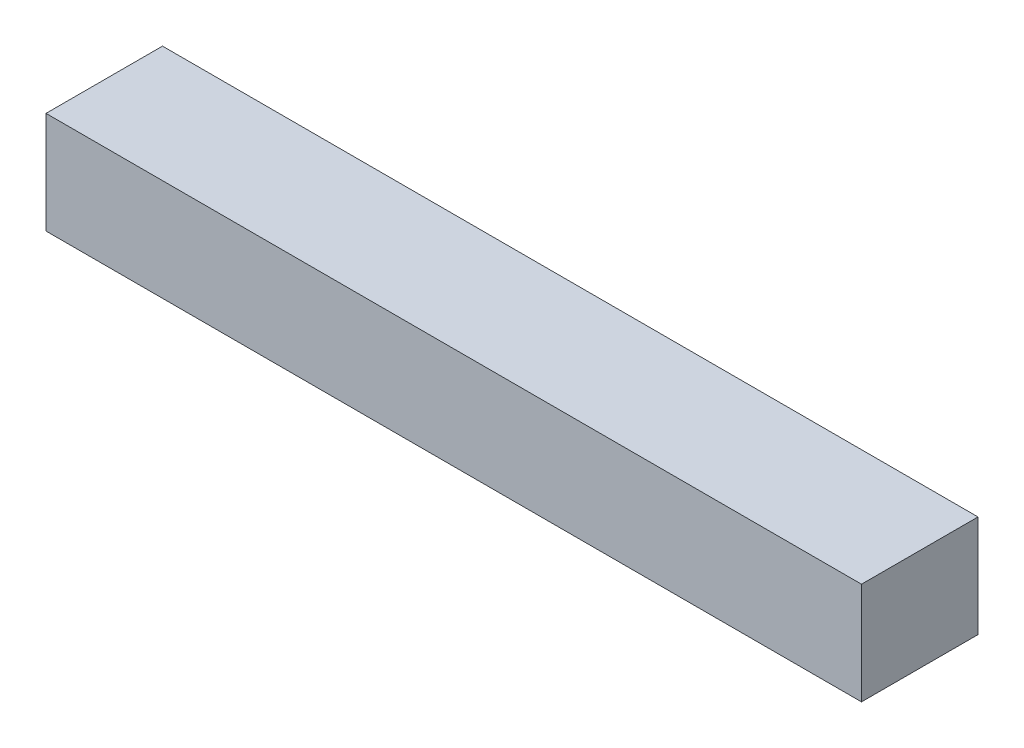
ISO-10303-21;
HEADER;
FILE_DESCRIPTION(('STEP AP214'),'2;1');
FILE_NAME('part.step','',(''),(''),'','','');
FILE_SCHEMA(('AUTOMOTIVE_DESIGN { 1 0 10303 214 1 1 1 1 }'));
ENDSEC;
DATA;
#1=APPLICATION_CONTEXT('core data for automotive mechanical design processes');
#2=APPLICATION_PROTOCOL_DEFINITION('international standard','automotive_design',2000,#1);
#3=PRODUCT_CONTEXT('',#1,'mechanical');
#4=PRODUCT('Part','Part','',(#3));
#5=PRODUCT_RELATED_PRODUCT_CATEGORY('part','',(#4));
#6=PRODUCT_DEFINITION_FORMATION('','',#4);
#7=PRODUCT_DEFINITION_CONTEXT('part definition',#1,'design');
#8=PRODUCT_DEFINITION('design','',#6,#7);
#9=PRODUCT_DEFINITION_SHAPE('','',#8);
#10=(LENGTH_UNIT() NAMED_UNIT(*) SI_UNIT(.MILLI.,.METRE.));
#11=(NAMED_UNIT(*) PLANE_ANGLE_UNIT() SI_UNIT($,.RADIAN.));
#12=(NAMED_UNIT(*) SI_UNIT($,.STERADIAN.) SOLID_ANGLE_UNIT());
#13=UNCERTAINTY_MEASURE_WITH_UNIT(LENGTH_MEASURE(1.E-05),#10,'distance_accuracy_value','');
#14=(GEOMETRIC_REPRESENTATION_CONTEXT(3) GLOBAL_UNCERTAINTY_ASSIGNED_CONTEXT((#13)) GLOBAL_UNIT_ASSIGNED_CONTEXT((#10,
#11,#12)) REPRESENTATION_CONTEXT('',''));
#15=CARTESIAN_POINT('',(0.,0.,0.));
#16=DIRECTION('',(0.,0.,1.));
#17=DIRECTION('',(1.,0.,0.));
#18=AXIS2_PLACEMENT_3D('',#15,#16,#17);
#19=CARTESIAN_POINT('',(56.,7.,12.));
#20=DIRECTION('',(-1.,0.,0.));
#21=DIRECTION('',(0.,0.,1.));
#22=AXIS2_PLACEMENT_3D('',#19,#20,#21);
#23=PLANE('',#22);
#24=DIRECTION('',(0.,1.,0.));
#25=VECTOR('',#24,1.);
#26=CARTESIAN_POINT('',(56.,7.,-4.));
#27=LINE('',#26,#25);
#28=CARTESIAN_POINT('',(56.,-7.,-4.));
#29=VERTEX_POINT('',#28);
#30=CARTESIAN_POINT('',(56.,7.,-4.));
#31=VERTEX_POINT('',#30);
#32=EDGE_CURVE('E112',#29,#31,#27,.T.);
#33=ORIENTED_EDGE('',*,*,#32,.T.);
#34=DIRECTION('',(0.,0.,-1.));
#35=VECTOR('',#34,1.);
#36=CARTESIAN_POINT('',(56.,7.,12.));
#37=LINE('',#36,#35);
#38=CARTESIAN_POINT('',(56.,7.,12.));
#39=VERTEX_POINT('',#38);
#40=EDGE_CURVE('E11',#39,#31,#37,.T.);
#41=ORIENTED_EDGE('',*,*,#40,.F.);
#42=DIRECTION('',(0.,1.,0.));
#43=VECTOR('',#42,1.);
#44=CARTESIAN_POINT('',(56.,7.,12.));
#45=LINE('',#44,#43);
#46=CARTESIAN_POINT('',(56.,-7.,12.));
#47=VERTEX_POINT('',#46);
#48=EDGE_CURVE('E100',#47,#39,#45,.T.);
#49=ORIENTED_EDGE('',*,*,#48,.F.);
#50=DIRECTION('',(0.,0.,-1.));
#51=VECTOR('',#50,1.);
#52=CARTESIAN_POINT('',(56.,-7.,12.));
#53=LINE('',#52,#51);
#54=EDGE_CURVE('E108',#47,#29,#53,.T.);
#55=ORIENTED_EDGE('',*,*,#54,.T.);
#56=EDGE_LOOP('',(#33,#41,#49,#55));
#57=FACE_BOUND('',#56,.T.);
#58=ADVANCED_FACE('F49',(#57),#23,.F.);
#59=CARTESIAN_POINT('',(-56.,7.,12.));
#60=DIRECTION('',(0.,-1.,0.));
#61=DIRECTION('',(0.,0.,-1.));
#62=AXIS2_PLACEMENT_3D('',#59,#60,#61);
#63=PLANE('',#62);
#64=DIRECTION('',(-1.,0.,0.));
#65=VECTOR('',#64,1.);
#66=CARTESIAN_POINT('',(-56.,7.,-4.));
#67=LINE('',#66,#65);
#68=CARTESIAN_POINT('',(-56.,7.,-4.));
#69=VERTEX_POINT('',#68);
#70=EDGE_CURVE('E104',#31,#69,#67,.T.);
#71=ORIENTED_EDGE('',*,*,#70,.T.);
#72=DIRECTION('',(0.,0.,-1.));
#73=VECTOR('',#72,1.);
#74=CARTESIAN_POINT('',(-56.,7.,12.));
#75=LINE('',#74,#73);
#76=CARTESIAN_POINT('',(-56.,7.,12.));
#77=VERTEX_POINT('',#76);
#78=EDGE_CURVE('E57',#77,#69,#75,.T.);
#79=ORIENTED_EDGE('',*,*,#78,.F.);
#80=DIRECTION('',(-1.,0.,0.));
#81=VECTOR('',#80,1.);
#82=CARTESIAN_POINT('',(-56.,7.,12.));
#83=LINE('',#82,#81);
#84=EDGE_CURVE('E95',#39,#77,#83,.T.);
#85=ORIENTED_EDGE('',*,*,#84,.F.);
#86=ORIENTED_EDGE('',*,*,#40,.T.);
#87=EDGE_LOOP('',(#71,#79,#85,#86));
#88=FACE_BOUND('',#87,.T.);
#89=ADVANCED_FACE('F103',(#88),#63,.F.);
#90=CARTESIAN_POINT('',(-56.,7.,12.));
#91=DIRECTION('',(1.,0.,0.));
#92=DIRECTION('',(0.,0.,-1.));
#93=AXIS2_PLACEMENT_3D('',#90,#91,#92);
#94=PLANE('',#93);
#95=DIRECTION('',(0.,-1.,0.));
#96=VECTOR('',#95,1.);
#97=CARTESIAN_POINT('',(-56.,7.,-4.));
#98=LINE('',#97,#96);
#99=CARTESIAN_POINT('',(-56.,-7.,-4.));
#100=VERTEX_POINT('',#99);
#101=EDGE_CURVE('E82',#69,#100,#98,.T.);
#102=ORIENTED_EDGE('',*,*,#101,.T.);
#103=DIRECTION('',(0.,0.,-1.));
#104=VECTOR('',#103,1.);
#105=CARTESIAN_POINT('',(-56.,-7.,12.));
#106=LINE('',#105,#104);
#107=CARTESIAN_POINT('',(-56.,-7.,12.));
#108=VERTEX_POINT('',#107);
#109=EDGE_CURVE('E105',#108,#100,#106,.T.);
#110=ORIENTED_EDGE('',*,*,#109,.F.);
#111=DIRECTION('',(0.,-1.,0.));
#112=VECTOR('',#111,1.);
#113=CARTESIAN_POINT('',(-56.,7.,12.));
#114=LINE('',#113,#112);
#115=EDGE_CURVE('E98',#77,#108,#114,.T.);
#116=ORIENTED_EDGE('',*,*,#115,.F.);
#117=ORIENTED_EDGE('',*,*,#78,.T.);
#118=EDGE_LOOP('',(#102,#110,#116,#117));
#119=FACE_BOUND('',#118,.T.);
#120=ADVANCED_FACE('F106',(#119),#94,.F.);
#121=CARTESIAN_POINT('',(-56.,-7.,12.));
#122=DIRECTION('',(0.,1.,0.));
#123=DIRECTION('',(0.,0.,1.));
#124=AXIS2_PLACEMENT_3D('',#121,#122,#123);
#125=PLANE('',#124);
#126=DIRECTION('',(1.,0.,0.));
#127=VECTOR('',#126,1.);
#128=CARTESIAN_POINT('',(-56.,-7.,-4.));
#129=LINE('',#128,#127);
#130=EDGE_CURVE('E88',#100,#29,#129,.T.);
#131=ORIENTED_EDGE('',*,*,#130,.T.);
#132=ORIENTED_EDGE('',*,*,#54,.F.);
#133=DIRECTION('',(1.,0.,0.));
#134=VECTOR('',#133,1.);
#135=CARTESIAN_POINT('',(-56.,-7.,12.));
#136=LINE('',#135,#134);
#137=EDGE_CURVE('E65',#108,#47,#136,.T.);
#138=ORIENTED_EDGE('',*,*,#137,.F.);
#139=ORIENTED_EDGE('',*,*,#109,.T.);
#140=EDGE_LOOP('',(#131,#132,#138,#139));
#141=FACE_BOUND('',#140,.T.);
#142=ADVANCED_FACE('F119',(#141),#125,.F.);
#143=CARTESIAN_POINT('',(0.,0.,12.));
#144=DIRECTION('',(0.,0.,1.));
#145=DIRECTION('',(1.,0.,0.));
#146=AXIS2_PLACEMENT_3D('',#143,#144,#145);
#147=PLANE('',#146);
#148=ORIENTED_EDGE('',*,*,#48,.T.);
#149=ORIENTED_EDGE('',*,*,#84,.T.);
#150=ORIENTED_EDGE('',*,*,#115,.T.);
#151=ORIENTED_EDGE('',*,*,#137,.T.);
#152=EDGE_LOOP('',(#148,#149,#150,#151));
#153=FACE_BOUND('',#152,.T.);
#154=ADVANCED_FACE('F96',(#153),#147,.T.);
#155=CARTESIAN_POINT('',(0.,0.,-4.));
#156=DIRECTION('',(0.,0.,1.));
#157=DIRECTION('',(1.,0.,0.));
#158=AXIS2_PLACEMENT_3D('',#155,#156,#157);
#159=PLANE('',#158);
#160=ORIENTED_EDGE('',*,*,#32,.F.);
#161=ORIENTED_EDGE('',*,*,#130,.F.);
#162=ORIENTED_EDGE('',*,*,#101,.F.);
#163=ORIENTED_EDGE('',*,*,#70,.F.);
#164=EDGE_LOOP('',(#160,#161,#162,#163));
#165=FACE_BOUND('',#164,.T.);
#166=ADVANCED_FACE('F122',(#165),#159,.F.);
#167=CLOSED_SHELL('',(#58,#89,#120,#142,#154,#166));
#168=MANIFOLD_SOLID_BREP('B2',#167);
#169=ADVANCED_BREP_SHAPE_REPRESENTATION('',(#18,#168),#14);
#170=SHAPE_DEFINITION_REPRESENTATION(#9,#169);
ENDSEC;
END-ISO-10303-21;
